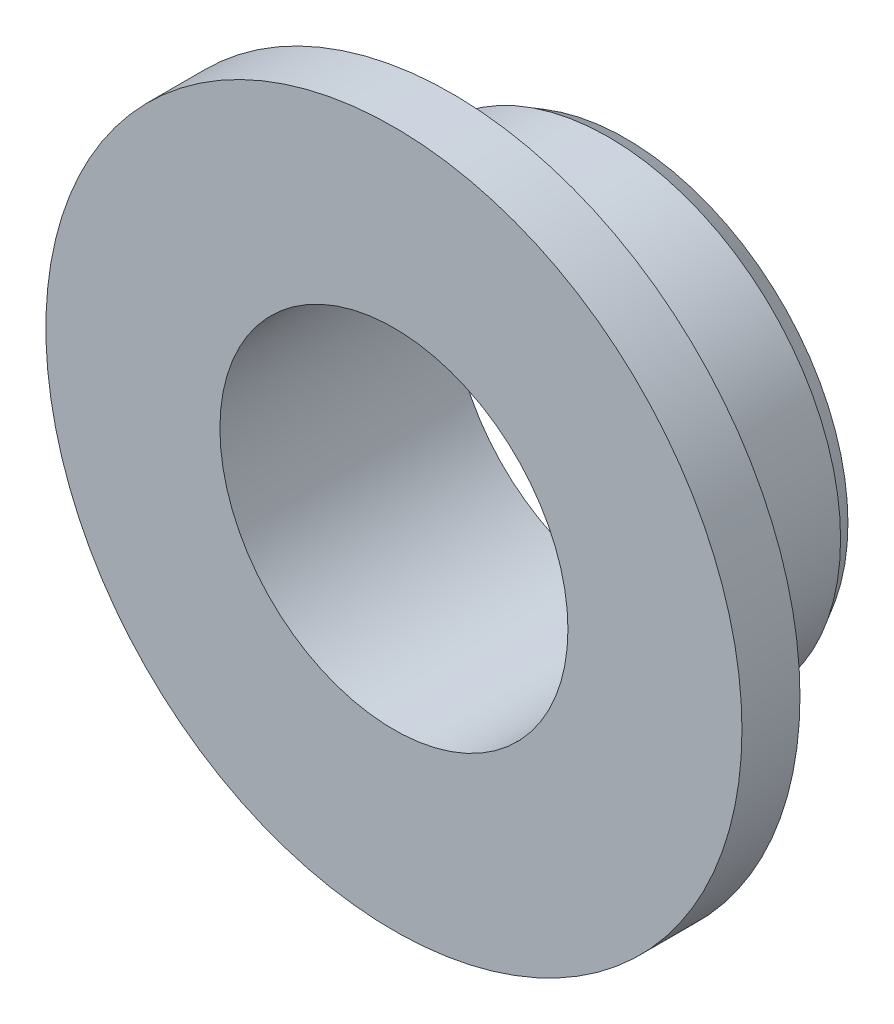
ISO-10303-21;
HEADER;
FILE_DESCRIPTION(('STEP AP214'),'2;1');
FILE_NAME('part.step','',(''),(''),'','','');
FILE_SCHEMA(('AUTOMOTIVE_DESIGN { 1 0 10303 214 1 1 1 1 }'));
ENDSEC;
DATA;
#1=APPLICATION_CONTEXT('core data for automotive mechanical design processes');
#2=APPLICATION_PROTOCOL_DEFINITION('international standard','automotive_design',2000,#1);
#3=PRODUCT_CONTEXT('',#1,'mechanical');
#4=PRODUCT('Part','Part','',(#3));
#5=PRODUCT_RELATED_PRODUCT_CATEGORY('part','',(#4));
#6=PRODUCT_DEFINITION_FORMATION('','',#4);
#7=PRODUCT_DEFINITION_CONTEXT('part definition',#1,'design');
#8=PRODUCT_DEFINITION('design','',#6,#7);
#9=PRODUCT_DEFINITION_SHAPE('','',#8);
#10=(LENGTH_UNIT() NAMED_UNIT(*) SI_UNIT(.MILLI.,.METRE.));
#11=(NAMED_UNIT(*) PLANE_ANGLE_UNIT() SI_UNIT($,.RADIAN.));
#12=(NAMED_UNIT(*) SI_UNIT($,.STERADIAN.) SOLID_ANGLE_UNIT());
#13=UNCERTAINTY_MEASURE_WITH_UNIT(LENGTH_MEASURE(1.E-05),#10,'distance_accuracy_value','');
#14=(GEOMETRIC_REPRESENTATION_CONTEXT(3) GLOBAL_UNCERTAINTY_ASSIGNED_CONTEXT((#13)) GLOBAL_UNIT_ASSIGNED_CONTEXT((#10,
#11,#12)) REPRESENTATION_CONTEXT('',''));
#15=CARTESIAN_POINT('',(0.,0.,0.));
#16=DIRECTION('',(0.,0.,1.));
#17=DIRECTION('',(1.,0.,0.));
#18=AXIS2_PLACEMENT_3D('',#15,#16,#17);
#19=CARTESIAN_POINT('',(0.,0.,4.));
#20=DIRECTION('',(0.,0.,-1.));
#21=DIRECTION('',(-1.,0.,0.));
#22=AXIS2_PLACEMENT_3D('',#19,#20,#21);
#23=CYLINDRICAL_SURFACE('',#22,4.);
#24=CARTESIAN_POINT('',(0.,0.,0.299999999999998));
#25=DIRECTION('',(0.,0.,1.));
#26=DIRECTION('',(1.,0.,0.));
#27=AXIS2_PLACEMENT_3D('',#24,#25,#26);
#28=CIRCLE('',#27,4.);
#29=CARTESIAN_POINT('',(4.,0.,0.299999999999998));
#30=VERTEX_POINT('',#29);
#31=EDGE_CURVE('E47',#30,#30,#28,.T.);
#32=ORIENTED_EDGE('',*,*,#31,.T.);
#33=EDGE_LOOP('',(#32));
#34=FACE_BOUND('',#33,.T.);
#35=CARTESIAN_POINT('',(0.,0.,2.5));
#36=DIRECTION('',(0.,0.,1.));
#37=DIRECTION('',(1.,0.,0.));
#38=AXIS2_PLACEMENT_3D('',#35,#36,#37);
#39=CIRCLE('',#38,4.);
#40=CARTESIAN_POINT('',(4.,0.,2.5));
#41=VERTEX_POINT('',#40);
#42=EDGE_CURVE('E52',#41,#41,#39,.F.);
#43=ORIENTED_EDGE('',*,*,#42,.T.);
#44=EDGE_LOOP('',(#43));
#45=FACE_BOUND('',#44,.T.);
#46=ADVANCED_FACE('F39',(#34,#45),#23,.T.);
#47=CARTESIAN_POINT('',(0.,0.,4.));
#48=DIRECTION('',(0.,0.,1.));
#49=DIRECTION('',(1.,0.,0.));
#50=AXIS2_PLACEMENT_3D('',#47,#48,#49);
#51=PLANE('',#50);
#52=CARTESIAN_POINT('',(0.,0.,4.));
#53=DIRECTION('',(0.,0.,1.));
#54=DIRECTION('',(1.,0.,0.));
#55=AXIS2_PLACEMENT_3D('',#52,#53,#54);
#56=CIRCLE('',#55,3.);
#57=CARTESIAN_POINT('',(3.,0.,4.));
#58=VERTEX_POINT('',#57);
#59=EDGE_CURVE('E63',#58,#58,#56,.T.);
#60=ORIENTED_EDGE('',*,*,#59,.F.);
#61=EDGE_LOOP('',(#60));
#62=FACE_BOUND('',#61,.T.);
#63=CARTESIAN_POINT('',(0.,0.,4.));
#64=DIRECTION('',(0.,0.,1.));
#65=DIRECTION('',(1.,0.,0.));
#66=AXIS2_PLACEMENT_3D('',#63,#64,#65);
#67=CIRCLE('',#66,6.);
#68=CARTESIAN_POINT('',(6.,0.,4.));
#69=VERTEX_POINT('',#68);
#70=EDGE_CURVE('E72',#69,#69,#67,.T.);
#71=ORIENTED_EDGE('',*,*,#70,.T.);
#72=EDGE_LOOP('',(#71));
#73=FACE_BOUND('',#72,.T.);
#74=ADVANCED_FACE('F98',(#62,#73),#51,.T.);
#75=CARTESIAN_POINT('',(0.,0.,0.));
#76=DIRECTION('',(0.,0.,1.));
#77=DIRECTION('',(1.,0.,0.));
#78=AXIS2_PLACEMENT_3D('',#75,#76,#77);
#79=PLANE('',#78);
#80=CARTESIAN_POINT('',(0.,0.,0.));
#81=DIRECTION('',(0.,0.,1.));
#82=DIRECTION('',(1.,0.,0.));
#83=AXIS2_PLACEMENT_3D('',#80,#81,#82);
#84=CIRCLE('',#83,3.82679491924311);
#85=CARTESIAN_POINT('',(3.82679491924311,0.,0.));
#86=VERTEX_POINT('',#85);
#87=EDGE_CURVE('E10',#86,#86,#84,.F.);
#88=ORIENTED_EDGE('',*,*,#87,.T.);
#89=EDGE_LOOP('',(#88));
#90=FACE_BOUND('',#89,.T.);
#91=CARTESIAN_POINT('',(0.,0.,0.));
#92=DIRECTION('',(0.,0.,1.));
#93=DIRECTION('',(1.,0.,0.));
#94=AXIS2_PLACEMENT_3D('',#91,#92,#93);
#95=CIRCLE('',#94,3.);
#96=CARTESIAN_POINT('',(3.,0.,0.));
#97=VERTEX_POINT('',#96);
#98=EDGE_CURVE('E64',#97,#97,#95,.T.);
#99=ORIENTED_EDGE('',*,*,#98,.T.);
#100=EDGE_LOOP('',(#99));
#101=FACE_BOUND('',#100,.T.);
#102=ADVANCED_FACE('F94',(#90,#101),#79,.F.);
#103=CARTESIAN_POINT('',(0.,0.,4.));
#104=DIRECTION('',(0.,0.,-1.));
#105=DIRECTION('',(-1.,0.,0.));
#106=AXIS2_PLACEMENT_3D('',#103,#104,#105);
#107=CYLINDRICAL_SURFACE('',#106,3.);
#108=ORIENTED_EDGE('',*,*,#59,.T.);
#109=EDGE_LOOP('',(#108));
#110=FACE_BOUND('',#109,.T.);
#111=ORIENTED_EDGE('',*,*,#98,.F.);
#112=EDGE_LOOP('',(#111));
#113=FACE_BOUND('',#112,.T.);
#114=ADVANCED_FACE('F85',(#110,#113),#107,.F.);
#115=CARTESIAN_POINT('',(0.,0.,3.));
#116=DIRECTION('',(0.,0.,1.));
#117=DIRECTION('',(1.,0.,0.));
#118=AXIS2_PLACEMENT_3D('',#115,#116,#117);
#119=PLANE('',#118);
#120=CARTESIAN_POINT('',(0.,0.,3.));
#121=DIRECTION('',(0.,0.,1.));
#122=DIRECTION('',(1.,0.,0.));
#123=AXIS2_PLACEMENT_3D('',#120,#121,#122);
#124=CIRCLE('',#123,4.5);
#125=CARTESIAN_POINT('',(4.5,0.,3.));
#126=VERTEX_POINT('',#125);
#127=EDGE_CURVE('E57',#126,#126,#124,.T.);
#128=ORIENTED_EDGE('',*,*,#127,.T.);
#129=EDGE_LOOP('',(#128));
#130=FACE_BOUND('',#129,.T.);
#131=CARTESIAN_POINT('',(0.,0.,3.));
#132=DIRECTION('',(0.,0.,1.));
#133=DIRECTION('',(1.,0.,0.));
#134=AXIS2_PLACEMENT_3D('',#131,#132,#133);
#135=CIRCLE('',#134,6.);
#136=CARTESIAN_POINT('',(6.,0.,3.));
#137=VERTEX_POINT('',#136);
#138=EDGE_CURVE('E68',#137,#137,#135,.T.);
#139=ORIENTED_EDGE('',*,*,#138,.F.);
#140=EDGE_LOOP('',(#139));
#141=FACE_BOUND('',#140,.T.);
#142=ADVANCED_FACE('F83',(#130,#141),#119,.F.);
#143=CARTESIAN_POINT('',(0.,0.,3.));
#144=DIRECTION('',(0.,0.,1.));
#145=DIRECTION('',(1.,0.,0.));
#146=AXIS2_PLACEMENT_3D('',#143,#144,#145);
#147=CYLINDRICAL_SURFACE('',#146,6.);
#148=ORIENTED_EDGE('',*,*,#138,.T.);
#149=EDGE_LOOP('',(#148));
#150=FACE_BOUND('',#149,.T.);
#151=ORIENTED_EDGE('',*,*,#70,.F.);
#152=EDGE_LOOP('',(#151));
#153=FACE_BOUND('',#152,.T.);
#154=ADVANCED_FACE('F80',(#150,#153),#147,.T.);
#155=CARTESIAN_POINT('',(0.,0.,2.5));
#156=DIRECTION('',(0.,0.,1.));
#157=DIRECTION('',(1.,0.,0.));
#158=AXIS2_PLACEMENT_3D('',#155,#156,#157);
#159=TOROIDAL_SURFACE('',#158,4.5,0.5);
#160=ORIENTED_EDGE('',*,*,#42,.F.);
#161=EDGE_LOOP('',(#160));
#162=FACE_BOUND('',#161,.T.);
#163=ORIENTED_EDGE('',*,*,#127,.F.);
#164=EDGE_LOOP('',(#163));
#165=FACE_BOUND('',#164,.T.);
#166=ADVANCED_FACE('F92',(#162,#165),#159,.F.);
#167=CARTESIAN_POINT('',(0.,0.,0.299999999999998));
#168=DIRECTION('',(0.,0.,1.));
#169=DIRECTION('',(1.,0.,0.));
#170=AXIS2_PLACEMENT_3D('',#167,#168,#169);
#171=CONICAL_SURFACE('',#170,4.,0.523598775598298);
#172=ORIENTED_EDGE('',*,*,#87,.F.);
#173=EDGE_LOOP('',(#172));
#174=FACE_BOUND('',#173,.T.);
#175=ORIENTED_EDGE('',*,*,#31,.F.);
#176=EDGE_LOOP('',(#175));
#177=FACE_BOUND('',#176,.T.);
#178=ADVANCED_FACE('F41',(#174,#177),#171,.T.);
#179=CLOSED_SHELL('',(#46,#74,#102,#114,#142,#154,#166,#178));
#180=MANIFOLD_SOLID_BREP('B2',#179);
#181=ADVANCED_BREP_SHAPE_REPRESENTATION('',(#18,#180),#14);
#182=SHAPE_DEFINITION_REPRESENTATION(#9,#181);
ENDSEC;
END-ISO-10303-21;
